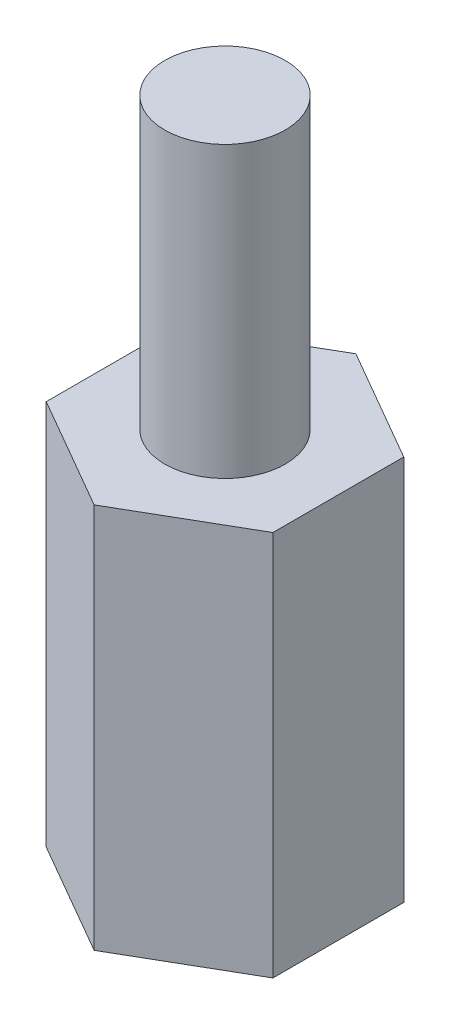
ISO-10303-21;
HEADER;
FILE_DESCRIPTION(('STEP AP214'),'2;1');
FILE_NAME('part.step','',(''),(''),'','','');
FILE_SCHEMA(('AUTOMOTIVE_DESIGN { 1 0 10303 214 1 1 1 1 }'));
ENDSEC;
DATA;
#1=APPLICATION_CONTEXT('core data for automotive mechanical design processes');
#2=APPLICATION_PROTOCOL_DEFINITION('international standard','automotive_design',2000,#1);
#3=PRODUCT_CONTEXT('',#1,'mechanical');
#4=PRODUCT('Part','Part','',(#3));
#5=PRODUCT_RELATED_PRODUCT_CATEGORY('part','',(#4));
#6=PRODUCT_DEFINITION_FORMATION('','',#4);
#7=PRODUCT_DEFINITION_CONTEXT('part definition',#1,'design');
#8=PRODUCT_DEFINITION('design','',#6,#7);
#9=PRODUCT_DEFINITION_SHAPE('','',#8);
#10=(LENGTH_UNIT() NAMED_UNIT(*) SI_UNIT(.MILLI.,.METRE.));
#11=(NAMED_UNIT(*) PLANE_ANGLE_UNIT() SI_UNIT($,.RADIAN.));
#12=(NAMED_UNIT(*) SI_UNIT($,.STERADIAN.) SOLID_ANGLE_UNIT());
#13=UNCERTAINTY_MEASURE_WITH_UNIT(LENGTH_MEASURE(1.E-05),#10,'distance_accuracy_value','');
#14=(GEOMETRIC_REPRESENTATION_CONTEXT(3) GLOBAL_UNCERTAINTY_ASSIGNED_CONTEXT((#13)) GLOBAL_UNIT_ASSIGNED_CONTEXT((#10,
#11,#12)) REPRESENTATION_CONTEXT('',''));
#15=CARTESIAN_POINT('',(0.,0.,0.));
#16=DIRECTION('',(0.,0.,1.));
#17=DIRECTION('',(1.,0.,0.));
#18=AXIS2_PLACEMENT_3D('',#15,#16,#17);
#19=CARTESIAN_POINT('',(2.34999999999999,8.,-1.35677313259565));
#20=DIRECTION('',(-0.499999999999995,0.,0.866025403784442));
#21=DIRECTION('',(0.866025403784442,0.,0.499999999999995));
#22=AXIS2_PLACEMENT_3D('',#19,#20,#21);
#23=PLANE('',#22);
#24=DIRECTION('',(-0.866025403784441,0.,-0.499999999999995));
#25=VECTOR('',#24,1.);
#26=CARTESIAN_POINT('',(2.34999999999999,0.,-1.35677313259565));
#27=LINE('',#26,#25);
#28=CARTESIAN_POINT('',(2.34999999999999,0.,-1.35677313259565));
#29=VERTEX_POINT('',#28);
#30=CARTESIAN_POINT('',(0.,0.,-2.71354626519124));
#31=VERTEX_POINT('',#30);
#32=EDGE_CURVE('E130',#29,#31,#27,.T.);
#33=ORIENTED_EDGE('',*,*,#32,.T.);
#34=DIRECTION('',(0.,-1.,0.));
#35=VECTOR('',#34,1.);
#36=CARTESIAN_POINT('',(0.,8.,-2.71354626519124));
#37=LINE('',#36,#35);
#38=CARTESIAN_POINT('',(0.,8.,-2.71354626519124));
#39=VERTEX_POINT('',#38);
#40=EDGE_CURVE('E43',#39,#31,#37,.T.);
#41=ORIENTED_EDGE('',*,*,#40,.F.);
#42=DIRECTION('',(-0.866025403784441,0.,-0.499999999999995));
#43=VECTOR('',#42,1.);
#44=CARTESIAN_POINT('',(2.34999999999999,8.,-1.35677313259565));
#45=LINE('',#44,#43);
#46=CARTESIAN_POINT('',(2.34999999999999,8.,-1.35677313259565));
#47=VERTEX_POINT('',#46);
#48=EDGE_CURVE('E145',#47,#39,#45,.T.);
#49=ORIENTED_EDGE('',*,*,#48,.F.);
#50=DIRECTION('',(0.,-1.,0.));
#51=VECTOR('',#50,1.);
#52=CARTESIAN_POINT('',(2.34999999999999,8.,-1.35677313259565));
#53=LINE('',#52,#51);
#54=EDGE_CURVE('E126',#47,#29,#53,.T.);
#55=ORIENTED_EDGE('',*,*,#54,.T.);
#56=EDGE_LOOP('',(#33,#41,#49,#55));
#57=FACE_BOUND('',#56,.T.);
#58=ADVANCED_FACE('F40',(#57),#23,.F.);
#59=CARTESIAN_POINT('',(0.,8.,-2.71354626519124));
#60=DIRECTION('',(0.500000000000001,0.,0.866025403784438));
#61=DIRECTION('',(0.866025403784438,0.,-0.500000000000001));
#62=AXIS2_PLACEMENT_3D('',#59,#60,#61);
#63=PLANE('',#62);
#64=DIRECTION('',(-0.866025403784438,0.,0.500000000000001));
#65=VECTOR('',#64,1.);
#66=CARTESIAN_POINT('',(0.,0.,-2.71354626519124));
#67=LINE('',#66,#65);
#68=CARTESIAN_POINT('',(-2.35,0.,-1.35677313259562));
#69=VERTEX_POINT('',#68);
#70=EDGE_CURVE('E134',#31,#69,#67,.T.);
#71=ORIENTED_EDGE('',*,*,#70,.T.);
#72=DIRECTION('',(0.,-1.,0.));
#73=VECTOR('',#72,1.);
#74=CARTESIAN_POINT('',(-2.35,8.,-1.35677313259562));
#75=LINE('',#74,#73);
#76=CARTESIAN_POINT('',(-2.35,8.,-1.35677313259562));
#77=VERTEX_POINT('',#76);
#78=EDGE_CURVE('E149',#77,#69,#75,.T.);
#79=ORIENTED_EDGE('',*,*,#78,.F.);
#80=DIRECTION('',(-0.866025403784438,0.,0.500000000000001));
#81=VECTOR('',#80,1.);
#82=CARTESIAN_POINT('',(0.,8.,-2.71354626519124));
#83=LINE('',#82,#81);
#84=EDGE_CURVE('E95',#39,#77,#83,.T.);
#85=ORIENTED_EDGE('',*,*,#84,.F.);
#86=ORIENTED_EDGE('',*,*,#40,.T.);
#87=EDGE_LOOP('',(#71,#79,#85,#86));
#88=FACE_BOUND('',#87,.T.);
#89=ADVANCED_FACE('F154',(#88),#63,.F.);
#90=CARTESIAN_POINT('',(-2.35,8.,-1.35677313259562));
#91=DIRECTION('',(1.,0.,0.));
#92=DIRECTION('',(0.,0.,-1.));
#93=AXIS2_PLACEMENT_3D('',#90,#91,#92);
#94=PLANE('',#93);
#95=DIRECTION('',(0.,0.,1.));
#96=VECTOR('',#95,1.);
#97=CARTESIAN_POINT('',(-2.35,0.,-1.35677313259562));
#98=LINE('',#97,#96);
#99=CARTESIAN_POINT('',(-2.35,0.,1.35677313259563));
#100=VERTEX_POINT('',#99);
#101=EDGE_CURVE('E137',#69,#100,#98,.T.);
#102=ORIENTED_EDGE('',*,*,#101,.T.);
#103=DIRECTION('',(0.,-1.,0.));
#104=VECTOR('',#103,1.);
#105=CARTESIAN_POINT('',(-2.35,8.,1.35677313259563));
#106=LINE('',#105,#104);
#107=CARTESIAN_POINT('',(-2.35,8.,1.35677313259563));
#108=VERTEX_POINT('',#107);
#109=EDGE_CURVE('E118',#108,#100,#106,.T.);
#110=ORIENTED_EDGE('',*,*,#109,.F.);
#111=DIRECTION('',(0.,0.,1.));
#112=VECTOR('',#111,1.);
#113=CARTESIAN_POINT('',(-2.35,8.,-1.35677313259562));
#114=LINE('',#113,#112);
#115=EDGE_CURVE('E108',#77,#108,#114,.T.);
#116=ORIENTED_EDGE('',*,*,#115,.F.);
#117=ORIENTED_EDGE('',*,*,#78,.T.);
#118=EDGE_LOOP('',(#102,#110,#116,#117));
#119=FACE_BOUND('',#118,.T.);
#120=ADVANCED_FACE('F160',(#119),#94,.F.);
#121=CARTESIAN_POINT('',(-2.35,8.,1.35677313259563));
#122=DIRECTION('',(0.499999999999995,0.,-0.866025403784442));
#123=DIRECTION('',(-0.866025403784442,0.,-0.499999999999995));
#124=AXIS2_PLACEMENT_3D('',#121,#122,#123);
#125=PLANE('',#124);
#126=DIRECTION('',(0.866025403784441,0.,0.499999999999995));
#127=VECTOR('',#126,1.);
#128=CARTESIAN_POINT('',(-2.35,0.,1.35677313259563));
#129=LINE('',#128,#127);
#130=CARTESIAN_POINT('',(0.,0.,2.71354626519124));
#131=VERTEX_POINT('',#130);
#132=EDGE_CURVE('E117',#100,#131,#129,.T.);
#133=ORIENTED_EDGE('',*,*,#132,.T.);
#134=DIRECTION('',(0.,-1.,0.));
#135=VECTOR('',#134,1.);
#136=CARTESIAN_POINT('',(0.,8.,2.71354626519124));
#137=LINE('',#136,#135);
#138=CARTESIAN_POINT('',(0.,8.,2.71354626519124));
#139=VERTEX_POINT('',#138);
#140=EDGE_CURVE('E114',#139,#131,#137,.T.);
#141=ORIENTED_EDGE('',*,*,#140,.F.);
#142=DIRECTION('',(0.866025403784441,0.,0.499999999999995));
#143=VECTOR('',#142,1.);
#144=CARTESIAN_POINT('',(-2.35,8.,1.35677313259563));
#145=LINE('',#144,#143);
#146=EDGE_CURVE('E102',#108,#139,#145,.T.);
#147=ORIENTED_EDGE('',*,*,#146,.F.);
#148=ORIENTED_EDGE('',*,*,#109,.T.);
#149=EDGE_LOOP('',(#133,#141,#147,#148));
#150=FACE_BOUND('',#149,.T.);
#151=ADVANCED_FACE('F115',(#150),#125,.F.);
#152=CARTESIAN_POINT('',(0.,8.,2.71354626519124));
#153=DIRECTION('',(-0.500000000000007,0.,-0.866025403784434));
#154=DIRECTION('',(-0.866025403784435,0.,0.500000000000007));
#155=AXIS2_PLACEMENT_3D('',#152,#153,#154);
#156=PLANE('',#155);
#157=DIRECTION('',(0.866025403784435,0.,-0.500000000000007));
#158=VECTOR('',#157,1.);
#159=CARTESIAN_POINT('',(0.,0.,2.71354626519124));
#160=LINE('',#159,#158);
#161=CARTESIAN_POINT('',(2.35000000000001,0.,1.3567731325956));
#162=VERTEX_POINT('',#161);
#163=EDGE_CURVE('E80',#131,#162,#160,.T.);
#164=ORIENTED_EDGE('',*,*,#163,.T.);
#165=DIRECTION('',(0.,-1.,0.));
#166=VECTOR('',#165,1.);
#167=CARTESIAN_POINT('',(2.35000000000001,8.,1.3567731325956));
#168=LINE('',#167,#166);
#169=CARTESIAN_POINT('',(2.35000000000001,8.,1.3567731325956));
#170=VERTEX_POINT('',#169);
#171=EDGE_CURVE('E119',#170,#162,#168,.T.);
#172=ORIENTED_EDGE('',*,*,#171,.F.);
#173=DIRECTION('',(0.866025403784435,0.,-0.500000000000007));
#174=VECTOR('',#173,1.);
#175=CARTESIAN_POINT('',(0.,8.,2.71354626519124));
#176=LINE('',#175,#174);
#177=EDGE_CURVE('E106',#139,#170,#176,.T.);
#178=ORIENTED_EDGE('',*,*,#177,.F.);
#179=ORIENTED_EDGE('',*,*,#140,.T.);
#180=EDGE_LOOP('',(#164,#172,#178,#179));
#181=FACE_BOUND('',#180,.T.);
#182=ADVANCED_FACE('F121',(#181),#156,.F.);
#183=CARTESIAN_POINT('',(2.35000000000001,8.,1.3567731325956));
#184=DIRECTION('',(-1.,0.,0.));
#185=DIRECTION('',(0.,0.,1.));
#186=AXIS2_PLACEMENT_3D('',#183,#184,#185);
#187=PLANE('',#186);
#188=DIRECTION('',(0.,0.,-1.));
#189=VECTOR('',#188,1.);
#190=CARTESIAN_POINT('',(2.35000000000001,0.,1.3567731325956));
#191=LINE('',#190,#189);
#192=EDGE_CURVE('E86',#162,#29,#191,.T.);
#193=ORIENTED_EDGE('',*,*,#192,.T.);
#194=ORIENTED_EDGE('',*,*,#54,.F.);
#195=DIRECTION('',(0.,0.,-1.));
#196=VECTOR('',#195,1.);
#197=CARTESIAN_POINT('',(2.35000000000001,8.,1.3567731325956));
#198=LINE('',#197,#196);
#199=EDGE_CURVE('E57',#170,#47,#198,.T.);
#200=ORIENTED_EDGE('',*,*,#199,.F.);
#201=ORIENTED_EDGE('',*,*,#171,.T.);
#202=EDGE_LOOP('',(#193,#194,#200,#201));
#203=FACE_BOUND('',#202,.T.);
#204=ADVANCED_FACE('F200',(#203),#187,.F.);
#205=CARTESIAN_POINT('',(0.,8.,0.));
#206=DIRECTION('',(0.,1.,0.));
#207=DIRECTION('',(0.,0.,1.));
#208=AXIS2_PLACEMENT_3D('',#205,#206,#207);
#209=PLANE('',#208);
#210=CARTESIAN_POINT('',(0.,8.,0.));
#211=DIRECTION('',(0.,1.,0.));
#212=DIRECTION('',(0.,0.,1.));
#213=AXIS2_PLACEMENT_3D('',#210,#211,#212);
#214=CIRCLE('',#213,1.25);
#215=CARTESIAN_POINT('',(0.,8.,1.25));
#216=VERTEX_POINT('',#215);
#217=EDGE_CURVE('E11',#216,#216,#214,.T.);
#218=ORIENTED_EDGE('',*,*,#217,.F.);
#219=EDGE_LOOP('',(#218));
#220=FACE_BOUND('',#219,.T.);
#221=ORIENTED_EDGE('',*,*,#48,.T.);
#222=ORIENTED_EDGE('',*,*,#84,.T.);
#223=ORIENTED_EDGE('',*,*,#115,.T.);
#224=ORIENTED_EDGE('',*,*,#146,.T.);
#225=ORIENTED_EDGE('',*,*,#177,.T.);
#226=ORIENTED_EDGE('',*,*,#199,.T.);
#227=EDGE_LOOP('',(#221,#222,#223,#224,#225,#226));
#228=FACE_BOUND('',#227,.T.);
#229=ADVANCED_FACE('F104',(#220,#228),#209,.T.);
#230=CARTESIAN_POINT('',(0.,0.,0.));
#231=DIRECTION('',(0.,1.,0.));
#232=DIRECTION('',(0.,0.,1.));
#233=AXIS2_PLACEMENT_3D('',#230,#231,#232);
#234=PLANE('',#233);
#235=CARTESIAN_POINT('',(0.,0.,0.));
#236=DIRECTION('',(0.,1.,0.));
#237=DIRECTION('',(0.,0.,1.));
#238=AXIS2_PLACEMENT_3D('',#235,#236,#237);
#239=CIRCLE('',#238,1.25);
#240=CARTESIAN_POINT('',(0.,0.,1.25));
#241=VERTEX_POINT('',#240);
#242=EDGE_CURVE('E169',#241,#241,#239,.T.);
#243=ORIENTED_EDGE('',*,*,#242,.T.);
#244=EDGE_LOOP('',(#243));
#245=FACE_BOUND('',#244,.T.);
#246=ORIENTED_EDGE('',*,*,#32,.F.);
#247=ORIENTED_EDGE('',*,*,#192,.F.);
#248=ORIENTED_EDGE('',*,*,#163,.F.);
#249=ORIENTED_EDGE('',*,*,#132,.F.);
#250=ORIENTED_EDGE('',*,*,#101,.F.);
#251=ORIENTED_EDGE('',*,*,#70,.F.);
#252=EDGE_LOOP('',(#246,#247,#248,#249,#250,#251));
#253=FACE_BOUND('',#252,.T.);
#254=ADVANCED_FACE('F159',(#245,#253),#234,.F.);
#255=CARTESIAN_POINT('',(0.,14.,0.));
#256=DIRECTION('',(0.,-1.,0.));
#257=DIRECTION('',(0.,0.,-1.));
#258=AXIS2_PLACEMENT_3D('',#255,#256,#257);
#259=CYLINDRICAL_SURFACE('',#258,1.25);
#260=CARTESIAN_POINT('',(0.,14.,0.));
#261=DIRECTION('',(0.,1.,0.));
#262=DIRECTION('',(0.,0.,1.));
#263=AXIS2_PLACEMENT_3D('',#260,#261,#262);
#264=CIRCLE('',#263,1.25);
#265=CARTESIAN_POINT('',(0.,14.,1.25));
#266=VERTEX_POINT('',#265);
#267=EDGE_CURVE('E135',#266,#266,#264,.T.);
#268=ORIENTED_EDGE('',*,*,#267,.F.);
#269=EDGE_LOOP('',(#268));
#270=FACE_BOUND('',#269,.T.);
#271=ORIENTED_EDGE('',*,*,#217,.T.);
#272=EDGE_LOOP('',(#271));
#273=FACE_BOUND('',#272,.T.);
#274=ADVANCED_FACE('F205',(#270,#273),#259,.T.);
#275=CARTESIAN_POINT('',(0.,14.,0.));
#276=DIRECTION('',(0.,1.,0.));
#277=DIRECTION('',(0.,0.,1.));
#278=AXIS2_PLACEMENT_3D('',#275,#276,#277);
#279=PLANE('',#278);
#280=ORIENTED_EDGE('',*,*,#267,.T.);
#281=EDGE_LOOP('',(#280));
#282=FACE_BOUND('',#281,.T.);
#283=ADVANCED_FACE('F185',(#282),#279,.T.);
#284=CARTESIAN_POINT('',(0.,6.,0.));
#285=DIRECTION('',(0.,-1.,0.));
#286=DIRECTION('',(0.,0.,-1.));
#287=AXIS2_PLACEMENT_3D('',#284,#285,#286);
#288=CYLINDRICAL_SURFACE('',#287,1.25);
#289=CARTESIAN_POINT('',(0.,6.,0.));
#290=DIRECTION('',(0.,1.,0.));
#291=DIRECTION('',(0.,0.,1.));
#292=AXIS2_PLACEMENT_3D('',#289,#290,#291);
#293=CIRCLE('',#292,1.25);
#294=CARTESIAN_POINT('',(0.,6.,1.25));
#295=VERTEX_POINT('',#294);
#296=EDGE_CURVE('E168',#295,#295,#293,.T.);
#297=ORIENTED_EDGE('',*,*,#296,.T.);
#298=EDGE_LOOP('',(#297));
#299=FACE_BOUND('',#298,.T.);
#300=ORIENTED_EDGE('',*,*,#242,.F.);
#301=EDGE_LOOP('',(#300));
#302=FACE_BOUND('',#301,.T.);
#303=ADVANCED_FACE('F176',(#299,#302),#288,.F.);
#304=CARTESIAN_POINT('',(0.,6.,0.));
#305=DIRECTION('',(0.,1.,0.));
#306=DIRECTION('',(0.,0.,1.));
#307=AXIS2_PLACEMENT_3D('',#304,#305,#306);
#308=PLANE('',#307);
#309=ORIENTED_EDGE('',*,*,#296,.F.);
#310=EDGE_LOOP('',(#309));
#311=FACE_BOUND('',#310,.T.);
#312=ADVANCED_FACE('F179',(#311),#308,.F.);
#313=CLOSED_SHELL('',(#58,#89,#120,#151,#182,#204,#229,#254,#274,#283,#303,#312));
#314=MANIFOLD_SOLID_BREP('B2',#313);
#315=ADVANCED_BREP_SHAPE_REPRESENTATION('',(#18,#314),#14);
#316=SHAPE_DEFINITION_REPRESENTATION(#9,#315);
ENDSEC;
END-ISO-10303-21;
